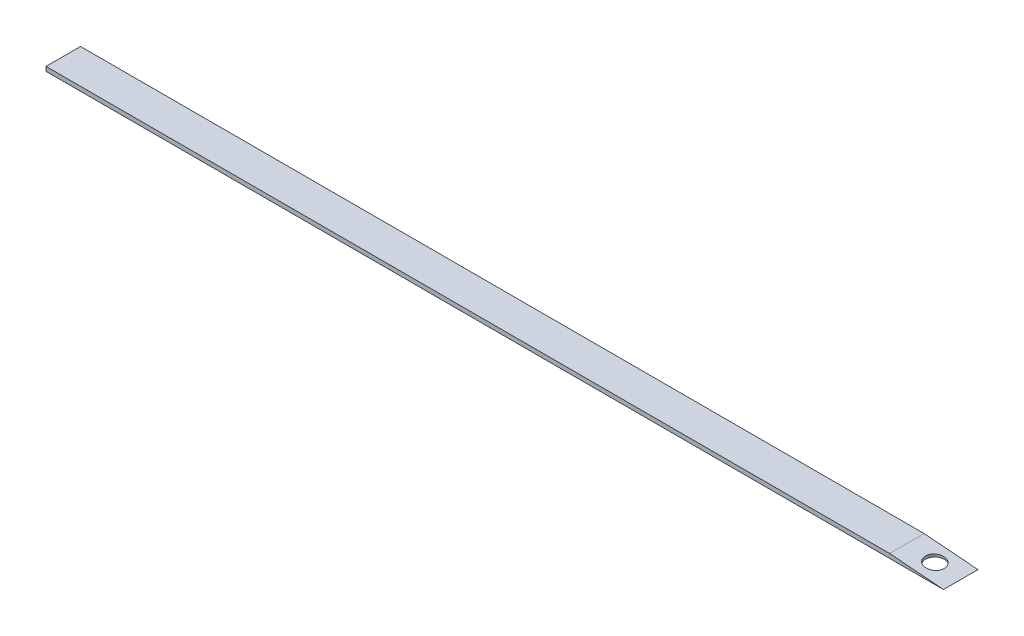
ISO-10303-21;
HEADER;
FILE_DESCRIPTION(('STEP AP214'),'2;1');
FILE_NAME('part.step','',(''),(''),'','','');
FILE_SCHEMA(('AUTOMOTIVE_DESIGN { 1 0 10303 214 1 1 1 1 }'));
ENDSEC;
DATA;
#1=APPLICATION_CONTEXT('core data for automotive mechanical design processes');
#2=APPLICATION_PROTOCOL_DEFINITION('international standard','automotive_design',2000,#1);
#3=PRODUCT_CONTEXT('',#1,'mechanical');
#4=PRODUCT('Part','Part','',(#3));
#5=PRODUCT_RELATED_PRODUCT_CATEGORY('part','',(#4));
#6=PRODUCT_DEFINITION_FORMATION('','',#4);
#7=PRODUCT_DEFINITION_CONTEXT('part definition',#1,'design');
#8=PRODUCT_DEFINITION('design','',#6,#7);
#9=PRODUCT_DEFINITION_SHAPE('','',#8);
#10=(LENGTH_UNIT() NAMED_UNIT(*) SI_UNIT(.MILLI.,.METRE.));
#11=(NAMED_UNIT(*) PLANE_ANGLE_UNIT() SI_UNIT($,.RADIAN.));
#12=(NAMED_UNIT(*) SI_UNIT($,.STERADIAN.) SOLID_ANGLE_UNIT());
#13=UNCERTAINTY_MEASURE_WITH_UNIT(LENGTH_MEASURE(1.E-05),#10,'distance_accuracy_value','');
#14=(GEOMETRIC_REPRESENTATION_CONTEXT(3) GLOBAL_UNCERTAINTY_ASSIGNED_CONTEXT((#13)) GLOBAL_UNIT_ASSIGNED_CONTEXT((#10,
#11,#12)) REPRESENTATION_CONTEXT('',''));
#15=CARTESIAN_POINT('',(0.,0.,0.));
#16=DIRECTION('',(0.,0.,1.));
#17=DIRECTION('',(1.,0.,0.));
#18=AXIS2_PLACEMENT_3D('',#15,#16,#17);
#19=CARTESIAN_POINT('',(330.2,1.5875,-6.34999999999999));
#20=DIRECTION('',(0.,1.,0.));
#21=DIRECTION('',(0.,0.,1.));
#22=AXIS2_PLACEMENT_3D('',#19,#20,#21);
#23=PLANE('',#22);
#24=DIRECTION('',(0.,0.,1.));
#25=VECTOR('',#24,1.);
#26=CARTESIAN_POINT('',(310.394618835127,1.5875,-6.34999999999999));
#27=LINE('',#26,#25);
#28=CARTESIAN_POINT('',(310.394618835127,1.5875,-6.34999999999999));
#29=VERTEX_POINT('',#28);
#30=CARTESIAN_POINT('',(310.394618835127,1.5875,6.35));
#31=VERTEX_POINT('',#30);
#32=EDGE_CURVE('E47',#29,#31,#27,.T.);
#33=ORIENTED_EDGE('',*,*,#32,.F.);
#34=DIRECTION('',(-1.,0.,0.));
#35=VECTOR('',#34,1.);
#36=CARTESIAN_POINT('',(330.2,1.5875,-6.34999999999999));
#37=LINE('',#36,#35);
#38=CARTESIAN_POINT('',(0.,1.5875,-6.34999999999999));
#39=VERTEX_POINT('',#38);
#40=EDGE_CURVE('E90',#29,#39,#37,.T.);
#41=ORIENTED_EDGE('',*,*,#40,.T.);
#42=DIRECTION('',(0.,0.,1.));
#43=VECTOR('',#42,1.);
#44=CARTESIAN_POINT('',(0.,1.5875,6.35));
#45=LINE('',#44,#43);
#46=CARTESIAN_POINT('',(0.,1.5875,6.35));
#47=VERTEX_POINT('',#46);
#48=EDGE_CURVE('E56',#39,#47,#45,.T.);
#49=ORIENTED_EDGE('',*,*,#48,.T.);
#50=DIRECTION('',(1.,0.,0.));
#51=VECTOR('',#50,1.);
#52=CARTESIAN_POINT('',(330.2,1.5875,6.35));
#53=LINE('',#52,#51);
#54=EDGE_CURVE('E84',#47,#31,#53,.T.);
#55=ORIENTED_EDGE('',*,*,#54,.T.);
#56=EDGE_LOOP('',(#33,#41,#49,#55));
#57=FACE_BOUND('',#56,.T.);
#58=ADVANCED_FACE('F31',(#57),#23,.T.);
#59=CARTESIAN_POINT('',(330.2,0.,-6.34999999999999));
#60=DIRECTION('',(0.,1.,0.));
#61=DIRECTION('',(0.,0.,1.));
#62=AXIS2_PLACEMENT_3D('',#59,#60,#61);
#63=PLANE('',#62);
#64=DIRECTION('',(0.,0.,-1.));
#65=VECTOR('',#64,1.);
#66=CARTESIAN_POINT('',(330.2,0.,6.35));
#67=LINE('',#66,#65);
#68=CARTESIAN_POINT('',(330.2,0.,6.35));
#69=VERTEX_POINT('',#68);
#70=CARTESIAN_POINT('',(330.2,0.,-6.34999999999999));
#71=VERTEX_POINT('',#70);
#72=EDGE_CURVE('E89',#69,#71,#67,.T.);
#73=ORIENTED_EDGE('',*,*,#72,.F.);
#74=DIRECTION('',(1.,0.,0.));
#75=VECTOR('',#74,1.);
#76=CARTESIAN_POINT('',(330.2,0.,6.35));
#77=LINE('',#76,#75);
#78=CARTESIAN_POINT('',(0.,0.,6.35));
#79=VERTEX_POINT('',#78);
#80=EDGE_CURVE('E76',#79,#69,#77,.T.);
#81=ORIENTED_EDGE('',*,*,#80,.F.);
#82=DIRECTION('',(0.,0.,1.));
#83=VECTOR('',#82,1.);
#84=CARTESIAN_POINT('',(0.,0.,6.35));
#85=LINE('',#84,#83);
#86=CARTESIAN_POINT('',(0.,0.,-6.34999999999999));
#87=VERTEX_POINT('',#86);
#88=EDGE_CURVE('E68',#87,#79,#85,.T.);
#89=ORIENTED_EDGE('',*,*,#88,.F.);
#90=DIRECTION('',(-1.,0.,0.));
#91=VECTOR('',#90,1.);
#92=CARTESIAN_POINT('',(330.2,0.,-6.34999999999999));
#93=LINE('',#92,#91);
#94=EDGE_CURVE('E77',#71,#87,#93,.T.);
#95=ORIENTED_EDGE('',*,*,#94,.F.);
#96=EDGE_LOOP('',(#73,#81,#89,#95));
#97=FACE_BOUND('',#96,.T.);
#98=CARTESIAN_POINT('',(320.675,0.,0.));
#99=DIRECTION('',(0.,1.,0.));
#100=DIRECTION('',(0.,0.,1.));
#101=AXIS2_PLACEMENT_3D('',#98,#99,#100);
#102=CIRCLE('',#101,3.429);
#103=CARTESIAN_POINT('',(320.675,0.,3.429));
#104=VERTEX_POINT('',#103);
#105=EDGE_CURVE('E96',#104,#104,#102,.T.);
#106=ORIENTED_EDGE('',*,*,#105,.T.);
#107=EDGE_LOOP('',(#106));
#108=FACE_BOUND('',#107,.T.);
#109=ADVANCED_FACE('F86',(#97,#108),#63,.F.);
#110=CARTESIAN_POINT('',(330.2,1.5875,-6.34999999999999));
#111=DIRECTION('',(0.,0.,1.));
#112=DIRECTION('',(1.,0.,0.));
#113=AXIS2_PLACEMENT_3D('',#110,#111,#112);
#114=PLANE('',#113);
#115=ORIENTED_EDGE('',*,*,#40,.F.);
#116=DIRECTION('',(0.996802986272039,-0.0798987268931454,0.));
#117=VECTOR('',#116,1.);
#118=CARTESIAN_POINT('',(301.954487885642,2.26401855678857,-6.34999999999999));
#119=LINE('',#118,#117);
#120=EDGE_CURVE('E102',#29,#71,#119,.T.);
#121=ORIENTED_EDGE('',*,*,#120,.T.);
#122=ORIENTED_EDGE('',*,*,#94,.T.);
#123=DIRECTION('',(0.,-1.,0.));
#124=VECTOR('',#123,1.);
#125=CARTESIAN_POINT('',(0.,1.5875,-6.34999999999999));
#126=LINE('',#125,#124);
#127=EDGE_CURVE('E11',#39,#87,#126,.T.);
#128=ORIENTED_EDGE('',*,*,#127,.F.);
#129=EDGE_LOOP('',(#115,#121,#122,#128));
#130=FACE_BOUND('',#129,.T.);
#131=ADVANCED_FACE('F33',(#130),#114,.F.);
#132=CARTESIAN_POINT('',(0.,1.5875,6.35));
#133=DIRECTION('',(1.,0.,0.));
#134=DIRECTION('',(0.,0.,-1.));
#135=AXIS2_PLACEMENT_3D('',#132,#133,#134);
#136=PLANE('',#135);
#137=ORIENTED_EDGE('',*,*,#88,.T.);
#138=DIRECTION('',(0.,-1.,0.));
#139=VECTOR('',#138,1.);
#140=CARTESIAN_POINT('',(0.,1.5875,6.35));
#141=LINE('',#140,#139);
#142=EDGE_CURVE('E40',#47,#79,#141,.T.);
#143=ORIENTED_EDGE('',*,*,#142,.F.);
#144=ORIENTED_EDGE('',*,*,#48,.F.);
#145=ORIENTED_EDGE('',*,*,#127,.T.);
#146=EDGE_LOOP('',(#137,#143,#144,#145));
#147=FACE_BOUND('',#146,.T.);
#148=ADVANCED_FACE('F70',(#147),#136,.F.);
#149=CARTESIAN_POINT('',(330.2,1.5875,6.35));
#150=DIRECTION('',(0.,0.,-1.));
#151=DIRECTION('',(-1.,0.,0.));
#152=AXIS2_PLACEMENT_3D('',#149,#150,#151);
#153=PLANE('',#152);
#154=ORIENTED_EDGE('',*,*,#80,.T.);
#155=DIRECTION('',(0.996802986272039,-0.0798987268931454,0.));
#156=VECTOR('',#155,1.);
#157=CARTESIAN_POINT('',(301.954487885642,2.26401855678857,6.35));
#158=LINE('',#157,#156);
#159=EDGE_CURVE('E105',#31,#69,#158,.T.);
#160=ORIENTED_EDGE('',*,*,#159,.F.);
#161=ORIENTED_EDGE('',*,*,#54,.F.);
#162=ORIENTED_EDGE('',*,*,#142,.T.);
#163=EDGE_LOOP('',(#154,#160,#161,#162));
#164=FACE_BOUND('',#163,.T.);
#165=ADVANCED_FACE('F81',(#164),#153,.F.);
#166=CARTESIAN_POINT('',(320.675,1.5875,0.));
#167=DIRECTION('',(0.,-1.,0.));
#168=DIRECTION('',(0.,0.,-1.));
#169=AXIS2_PLACEMENT_3D('',#166,#167,#168);
#170=CYLINDRICAL_SURFACE('',#169,3.429);
#171=CARTESIAN_POINT('',(320.675,0.763476217605869,0.));
#172=DIRECTION('',(-0.0798987268931454,-0.996802986272039,0.));
#173=DIRECTION('',(0.996802986272039,-0.0798987268931454,0.));
#174=AXIS2_PLACEMENT_3D('',#171,#172,#173);
#175=ELLIPSE('',#174,3.43999771993479,3.429);
#176=CARTESIAN_POINT('',(324.104,0.488624779267756,0.));
#177=VERTEX_POINT('',#176);
#178=EDGE_CURVE('E35',#177,#177,#175,.T.);
#179=ORIENTED_EDGE('',*,*,#178,.F.);
#180=EDGE_LOOP('',(#179));
#181=FACE_BOUND('',#180,.T.);
#182=ORIENTED_EDGE('',*,*,#105,.F.);
#183=EDGE_LOOP('',(#182));
#184=FACE_BOUND('',#183,.T.);
#185=ADVANCED_FACE('F124',(#181,#184),#170,.F.);
#186=CARTESIAN_POINT('',(301.954487885642,2.26401855678857,-6.34999999999999));
#187=DIRECTION('',(-0.0798987268931454,-0.996802986272039,0.));
#188=DIRECTION('',(0.996802986272039,-0.0798987268931454,0.));
#189=AXIS2_PLACEMENT_3D('',#186,#187,#188);
#190=PLANE('',#189);
#191=ORIENTED_EDGE('',*,*,#32,.T.);
#192=ORIENTED_EDGE('',*,*,#159,.T.);
#193=ORIENTED_EDGE('',*,*,#72,.T.);
#194=ORIENTED_EDGE('',*,*,#120,.F.);
#195=EDGE_LOOP('',(#191,#192,#193,#194));
#196=FACE_BOUND('',#195,.T.);
#197=ORIENTED_EDGE('',*,*,#178,.T.);
#198=EDGE_LOOP('',(#197));
#199=FACE_BOUND('',#198,.T.);
#200=ADVANCED_FACE('F106',(#196,#199),#190,.F.);
#201=CLOSED_SHELL('',(#58,#109,#131,#148,#165,#185,#200));
#202=MANIFOLD_SOLID_BREP('B2',#201);
#203=ADVANCED_BREP_SHAPE_REPRESENTATION('',(#18,#202),#14);
#204=SHAPE_DEFINITION_REPRESENTATION(#9,#203);
ENDSEC;
END-ISO-10303-21;
